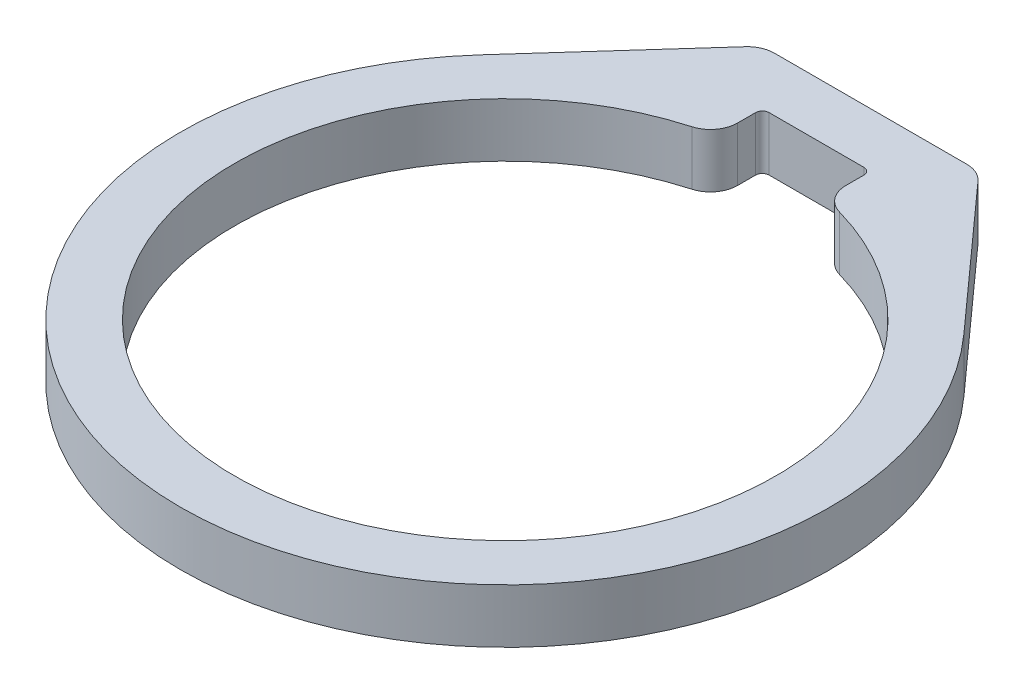
ISO-10303-21;
HEADER;
FILE_DESCRIPTION(('STEP AP214'),'2;1');
FILE_NAME('part.step','',(''),(''),'','','');
FILE_SCHEMA(('AUTOMOTIVE_DESIGN { 1 0 10303 214 1 1 1 1 }'));
ENDSEC;
DATA;
#1=APPLICATION_CONTEXT('core data for automotive mechanical design processes');
#2=APPLICATION_PROTOCOL_DEFINITION('international standard','automotive_design',2000,#1);
#3=PRODUCT_CONTEXT('',#1,'mechanical');
#4=PRODUCT('Part','Part','',(#3));
#5=PRODUCT_RELATED_PRODUCT_CATEGORY('part','',(#4));
#6=PRODUCT_DEFINITION_FORMATION('','',#4);
#7=PRODUCT_DEFINITION_CONTEXT('part definition',#1,'design');
#8=PRODUCT_DEFINITION('design','',#6,#7);
#9=PRODUCT_DEFINITION_SHAPE('','',#8);
#10=(LENGTH_UNIT() NAMED_UNIT(*) SI_UNIT(.MILLI.,.METRE.));
#11=(NAMED_UNIT(*) PLANE_ANGLE_UNIT() SI_UNIT($,.RADIAN.));
#12=(NAMED_UNIT(*) SI_UNIT($,.STERADIAN.) SOLID_ANGLE_UNIT());
#13=UNCERTAINTY_MEASURE_WITH_UNIT(LENGTH_MEASURE(1.E-05),#10,'distance_accuracy_value','');
#14=(GEOMETRIC_REPRESENTATION_CONTEXT(3) GLOBAL_UNCERTAINTY_ASSIGNED_CONTEXT((#13)) GLOBAL_UNIT_ASSIGNED_CONTEXT((#10,
#11,#12)) REPRESENTATION_CONTEXT('',''));
#15=CARTESIAN_POINT('',(0.,0.,0.));
#16=DIRECTION('',(0.,0.,1.));
#17=DIRECTION('',(1.,0.,0.));
#18=AXIS2_PLACEMENT_3D('',#15,#16,#17);
#19=CARTESIAN_POINT('',(0.,6.35,0.));
#20=DIRECTION('',(0.,1.,0.));
#21=DIRECTION('',(0.,0.,1.));
#22=AXIS2_PLACEMENT_3D('',#19,#20,#21);
#23=PLANE('',#22);
#24=DIRECTION('',(-0.668540531019861,0.,-0.743675707807968));
#25=VECTOR('',#24,1.);
#26=CARTESIAN_POINT('',(12.7,6.35,-42.8625));
#27=LINE('',#26,#25);
#28=CARTESIAN_POINT('',(28.3340444674836,6.35,-25.4713942318567));
#29=VERTEX_POINT('',#28);
#30=CARTESIAN_POINT('',(13.6460591847622,6.35,-41.8101161859881));
#31=VERTEX_POINT('',#30);
#32=EDGE_CURVE('E139',#29,#31,#27,.T.);
#33=ORIENTED_EDGE('',*,*,#32,.T.);
#34=CARTESIAN_POINT('',(11.2848888124719,6.35,-39.6875));
#35=DIRECTION('',(0.,1.,0.));
#36=DIRECTION('',(0.,0.,1.));
#37=AXIS2_PLACEMENT_3D('',#34,#35,#36);
#38=CIRCLE('',#37,3.175);
#39=CARTESIAN_POINT('',(11.2848888124719,6.35,-42.8625));
#40=VERTEX_POINT('',#39);
#41=EDGE_CURVE('E207',#31,#40,#38,.T.);
#42=ORIENTED_EDGE('',*,*,#41,.T.);
#43=DIRECTION('',(-1.,0.,0.));
#44=VECTOR('',#43,1.);
#45=CARTESIAN_POINT('',(-12.7,6.35,-42.8625));
#46=LINE('',#45,#44);
#47=CARTESIAN_POINT('',(-11.2848888124719,6.35,-42.8625));
#48=VERTEX_POINT('',#47);
#49=EDGE_CURVE('E150',#40,#48,#46,.T.);
#50=ORIENTED_EDGE('',*,*,#49,.T.);
#51=CARTESIAN_POINT('',(-11.2848888124719,6.35,-39.6875));
#52=DIRECTION('',(0.,1.,0.));
#53=DIRECTION('',(0.,0.,1.));
#54=AXIS2_PLACEMENT_3D('',#51,#52,#53);
#55=CIRCLE('',#54,3.175);
#56=CARTESIAN_POINT('',(-13.6460591847622,6.35,-41.8101161859881));
#57=VERTEX_POINT('',#56);
#58=EDGE_CURVE('E205',#48,#57,#55,.T.);
#59=ORIENTED_EDGE('',*,*,#58,.T.);
#60=DIRECTION('',(-0.668540531019861,0.,0.743675707807968));
#61=VECTOR('',#60,1.);
#62=CARTESIAN_POINT('',(-12.7,6.35,-42.8625));
#63=LINE('',#62,#61);
#64=CARTESIAN_POINT('',(-28.3340444674836,6.35,-25.4713942318567));
#65=VERTEX_POINT('',#64);
#66=EDGE_CURVE('E155',#57,#65,#63,.T.);
#67=ORIENTED_EDGE('',*,*,#66,.T.);
#68=CARTESIAN_POINT('',(0.,6.35,0.));
#69=DIRECTION('',(0.,1.,0.));
#70=DIRECTION('',(0.,0.,1.));
#71=AXIS2_PLACEMENT_3D('',#68,#69,#70);
#72=CIRCLE('',#71,38.1);
#73=EDGE_CURVE('E151',#65,#29,#72,.T.);
#74=ORIENTED_EDGE('',*,*,#73,.T.);
#75=EDGE_LOOP('',(#33,#42,#50,#59,#67,#74));
#76=FACE_BOUND('',#75,.T.);
#77=DIRECTION('',(0.,0.,-1.));
#78=VECTOR('',#77,1.);
#79=CARTESIAN_POINT('',(6.35,6.35,-36.5125));
#80=LINE('',#79,#78);
#81=CARTESIAN_POINT('',(6.35,6.35,-33.6010416505203));
#82=VERTEX_POINT('',#81);
#83=CARTESIAN_POINT('',(6.35,6.35,-35.71875));
#84=VERTEX_POINT('',#83);
#85=EDGE_CURVE('E311',#82,#84,#80,.T.);
#86=ORIENTED_EDGE('',*,*,#85,.F.);
#87=CARTESIAN_POINT('',(9.525,6.35,-33.6010416505203));
#88=DIRECTION('',(0.,1.,0.));
#89=DIRECTION('',(0.,0.,1.));
#90=AXIS2_PLACEMENT_3D('',#87,#88,#89);
#91=CIRCLE('',#90,3.175);
#92=CARTESIAN_POINT('',(8.65909090909091,6.35,-30.546401500473));
#93=VERTEX_POINT('',#92);
#94=EDGE_CURVE('E203',#82,#93,#91,.T.);
#95=ORIENTED_EDGE('',*,*,#94,.T.);
#96=CARTESIAN_POINT('',(0.,6.35,0.));
#97=DIRECTION('',(0.,1.,0.));
#98=DIRECTION('',(0.,0.,1.));
#99=AXIS2_PLACEMENT_3D('',#96,#97,#98);
#100=CIRCLE('',#99,31.75);
#101=CARTESIAN_POINT('',(-8.65909090909091,6.35,-30.546401500473));
#102=VERTEX_POINT('',#101);
#103=EDGE_CURVE('E224',#102,#93,#100,.T.);
#104=ORIENTED_EDGE('',*,*,#103,.F.);
#105=CARTESIAN_POINT('',(-9.525,6.35,-33.6010416505203));
#106=DIRECTION('',(0.,1.,0.));
#107=DIRECTION('',(0.,0.,1.));
#108=AXIS2_PLACEMENT_3D('',#105,#106,#107);
#109=CIRCLE('',#108,3.175);
#110=CARTESIAN_POINT('',(-6.35,6.35,-33.6010416505203));
#111=VERTEX_POINT('',#110);
#112=EDGE_CURVE('E58',#102,#111,#109,.T.);
#113=ORIENTED_EDGE('',*,*,#112,.T.);
#114=DIRECTION('',(0.,0.,1.));
#115=VECTOR('',#114,1.);
#116=CARTESIAN_POINT('',(-6.35,6.35,-36.5125));
#117=LINE('',#116,#115);
#118=CARTESIAN_POINT('',(-6.35,6.35,-35.71875));
#119=VERTEX_POINT('',#118);
#120=EDGE_CURVE('E239',#119,#111,#117,.T.);
#121=ORIENTED_EDGE('',*,*,#120,.F.);
#122=CARTESIAN_POINT('',(-5.55625,6.35,-35.71875));
#123=DIRECTION('',(0.,1.,0.));
#124=DIRECTION('',(0.,0.,1.));
#125=AXIS2_PLACEMENT_3D('',#122,#123,#124);
#126=CIRCLE('',#125,0.79375);
#127=CARTESIAN_POINT('',(-5.55625,6.35,-36.5125));
#128=VERTEX_POINT('',#127);
#129=EDGE_CURVE('E186',#119,#128,#126,.F.);
#130=ORIENTED_EDGE('',*,*,#129,.T.);
#131=DIRECTION('',(-1.,0.,0.));
#132=VECTOR('',#131,1.);
#133=CARTESIAN_POINT('',(-6.35,6.35,-36.5125));
#134=LINE('',#133,#132);
#135=CARTESIAN_POINT('',(5.55625,6.35,-36.5125));
#136=VERTEX_POINT('',#135);
#137=EDGE_CURVE('E246',#136,#128,#134,.T.);
#138=ORIENTED_EDGE('',*,*,#137,.F.);
#139=CARTESIAN_POINT('',(5.55625,6.35,-35.71875));
#140=DIRECTION('',(0.,1.,0.));
#141=DIRECTION('',(0.,0.,1.));
#142=AXIS2_PLACEMENT_3D('',#139,#140,#141);
#143=CIRCLE('',#142,0.79375);
#144=EDGE_CURVE('E181',#136,#84,#143,.F.);
#145=ORIENTED_EDGE('',*,*,#144,.T.);
#146=EDGE_LOOP('',(#86,#95,#104,#113,#121,#130,#138,#145));
#147=FACE_BOUND('',#146,.T.);
#148=ADVANCED_FACE('F36',(#76,#147),#23,.T.);
#149=CARTESIAN_POINT('',(0.,0.,0.));
#150=DIRECTION('',(0.,1.,0.));
#151=DIRECTION('',(0.,0.,1.));
#152=AXIS2_PLACEMENT_3D('',#149,#150,#151);
#153=PLANE('',#152);
#154=DIRECTION('',(-1.,0.,0.));
#155=VECTOR('',#154,1.);
#156=CARTESIAN_POINT('',(-12.7,0.,-42.8625));
#157=LINE('',#156,#155);
#158=CARTESIAN_POINT('',(11.2848888124719,0.,-42.8625));
#159=VERTEX_POINT('',#158);
#160=CARTESIAN_POINT('',(-11.2848888124719,0.,-42.8625));
#161=VERTEX_POINT('',#160);
#162=EDGE_CURVE('E248',#159,#161,#157,.T.);
#163=ORIENTED_EDGE('',*,*,#162,.F.);
#164=CARTESIAN_POINT('',(11.2848888124719,0.,-39.6875));
#165=DIRECTION('',(0.,1.,0.));
#166=DIRECTION('',(0.,0.,1.));
#167=AXIS2_PLACEMENT_3D('',#164,#165,#166);
#168=CIRCLE('',#167,3.175);
#169=CARTESIAN_POINT('',(13.6460591847622,0.,-41.8101161859881));
#170=VERTEX_POINT('',#169);
#171=EDGE_CURVE('E199',#159,#170,#168,.F.);
#172=ORIENTED_EDGE('',*,*,#171,.T.);
#173=DIRECTION('',(-0.668540531019861,0.,-0.743675707807968));
#174=VECTOR('',#173,1.);
#175=CARTESIAN_POINT('',(12.7,0.,-42.8625));
#176=LINE('',#175,#174);
#177=CARTESIAN_POINT('',(28.3340444674836,0.,-25.4713942318567));
#178=VERTEX_POINT('',#177);
#179=EDGE_CURVE('E245',#178,#170,#176,.T.);
#180=ORIENTED_EDGE('',*,*,#179,.F.);
#181=CARTESIAN_POINT('',(0.,0.,0.));
#182=DIRECTION('',(0.,1.,0.));
#183=DIRECTION('',(0.,0.,1.));
#184=AXIS2_PLACEMENT_3D('',#181,#182,#183);
#185=CIRCLE('',#184,38.1);
#186=CARTESIAN_POINT('',(-28.3340444674836,0.,-25.4713942318567));
#187=VERTEX_POINT('',#186);
#188=EDGE_CURVE('E163',#187,#178,#185,.T.);
#189=ORIENTED_EDGE('',*,*,#188,.F.);
#190=DIRECTION('',(-0.668540531019861,0.,0.743675707807968));
#191=VECTOR('',#190,1.);
#192=CARTESIAN_POINT('',(-12.7,0.,-42.8625));
#193=LINE('',#192,#191);
#194=CARTESIAN_POINT('',(-13.6460591847622,0.,-41.8101161859881));
#195=VERTEX_POINT('',#194);
#196=EDGE_CURVE('E159',#195,#187,#193,.T.);
#197=ORIENTED_EDGE('',*,*,#196,.F.);
#198=CARTESIAN_POINT('',(-11.2848888124719,0.,-39.6875));
#199=DIRECTION('',(0.,1.,0.));
#200=DIRECTION('',(0.,0.,1.));
#201=AXIS2_PLACEMENT_3D('',#198,#199,#200);
#202=CIRCLE('',#201,3.175);
#203=EDGE_CURVE('E197',#195,#161,#202,.F.);
#204=ORIENTED_EDGE('',*,*,#203,.T.);
#205=EDGE_LOOP('',(#163,#172,#180,#189,#197,#204));
#206=FACE_BOUND('',#205,.T.);
#207=CARTESIAN_POINT('',(0.,0.,0.));
#208=DIRECTION('',(0.,1.,0.));
#209=DIRECTION('',(0.,0.,1.));
#210=AXIS2_PLACEMENT_3D('',#207,#208,#209);
#211=CIRCLE('',#210,31.75);
#212=CARTESIAN_POINT('',(-8.65909090909091,0.,-30.546401500473));
#213=VERTEX_POINT('',#212);
#214=CARTESIAN_POINT('',(8.65909090909091,0.,-30.546401500473));
#215=VERTEX_POINT('',#214);
#216=EDGE_CURVE('E222',#213,#215,#211,.T.);
#217=ORIENTED_EDGE('',*,*,#216,.T.);
#218=CARTESIAN_POINT('',(9.525,0.,-33.6010416505203));
#219=DIRECTION('',(0.,1.,0.));
#220=DIRECTION('',(0.,0.,1.));
#221=AXIS2_PLACEMENT_3D('',#218,#219,#220);
#222=CIRCLE('',#221,3.175);
#223=CARTESIAN_POINT('',(6.35,0.,-33.6010416505203));
#224=VERTEX_POINT('',#223);
#225=EDGE_CURVE('E195',#215,#224,#222,.F.);
#226=ORIENTED_EDGE('',*,*,#225,.T.);
#227=DIRECTION('',(0.,0.,-1.));
#228=VECTOR('',#227,1.);
#229=CARTESIAN_POINT('',(6.35,0.,-36.5125));
#230=LINE('',#229,#228);
#231=CARTESIAN_POINT('',(6.35,0.,-35.71875));
#232=VERTEX_POINT('',#231);
#233=EDGE_CURVE('E230',#224,#232,#230,.T.);
#234=ORIENTED_EDGE('',*,*,#233,.T.);
#235=CARTESIAN_POINT('',(5.55625,0.,-35.71875));
#236=DIRECTION('',(0.,1.,0.));
#237=DIRECTION('',(0.,0.,1.));
#238=AXIS2_PLACEMENT_3D('',#235,#236,#237);
#239=CIRCLE('',#238,0.79375);
#240=CARTESIAN_POINT('',(5.55625,0.,-36.5125));
#241=VERTEX_POINT('',#240);
#242=EDGE_CURVE('E179',#232,#241,#239,.T.);
#243=ORIENTED_EDGE('',*,*,#242,.T.);
#244=DIRECTION('',(-1.,0.,0.));
#245=VECTOR('',#244,1.);
#246=CARTESIAN_POINT('',(-6.35,0.,-36.5125));
#247=LINE('',#246,#245);
#248=CARTESIAN_POINT('',(-5.55625,0.,-36.5125));
#249=VERTEX_POINT('',#248);
#250=EDGE_CURVE('E233',#241,#249,#247,.T.);
#251=ORIENTED_EDGE('',*,*,#250,.T.);
#252=CARTESIAN_POINT('',(-5.55625,0.,-35.71875));
#253=DIRECTION('',(0.,1.,0.));
#254=DIRECTION('',(0.,0.,1.));
#255=AXIS2_PLACEMENT_3D('',#252,#253,#254);
#256=CIRCLE('',#255,0.79375);
#257=CARTESIAN_POINT('',(-6.35,0.,-35.71875));
#258=VERTEX_POINT('',#257);
#259=EDGE_CURVE('E184',#249,#258,#256,.T.);
#260=ORIENTED_EDGE('',*,*,#259,.T.);
#261=DIRECTION('',(0.,0.,1.));
#262=VECTOR('',#261,1.);
#263=CARTESIAN_POINT('',(-6.35,0.,-36.5125));
#264=LINE('',#263,#262);
#265=CARTESIAN_POINT('',(-6.35,0.,-33.6010416505203));
#266=VERTEX_POINT('',#265);
#267=EDGE_CURVE('E231',#258,#266,#264,.T.);
#268=ORIENTED_EDGE('',*,*,#267,.T.);
#269=CARTESIAN_POINT('',(-9.525,0.,-33.6010416505203));
#270=DIRECTION('',(0.,1.,0.));
#271=DIRECTION('',(0.,0.,1.));
#272=AXIS2_PLACEMENT_3D('',#269,#270,#271);
#273=CIRCLE('',#272,3.175);
#274=EDGE_CURVE('E193',#266,#213,#273,.F.);
#275=ORIENTED_EDGE('',*,*,#274,.T.);
#276=EDGE_LOOP('',(#217,#226,#234,#243,#251,#260,#268,#275));
#277=FACE_BOUND('',#276,.T.);
#278=ADVANCED_FACE('F228',(#206,#277),#153,.F.);
#279=CARTESIAN_POINT('',(0.,6.35,0.));
#280=DIRECTION('',(0.,-1.,0.));
#281=DIRECTION('',(0.,0.,-1.));
#282=AXIS2_PLACEMENT_3D('',#279,#280,#281);
#283=CYLINDRICAL_SURFACE('',#282,38.1);
#284=ORIENTED_EDGE('',*,*,#188,.T.);
#285=DIRECTION('',(0.,-1.,0.));
#286=VECTOR('',#285,1.);
#287=CARTESIAN_POINT('',(28.3340444674836,6.35,-25.4713942318567));
#288=LINE('',#287,#286);
#289=EDGE_CURVE('E144',#29,#178,#288,.T.);
#290=ORIENTED_EDGE('',*,*,#289,.F.);
#291=ORIENTED_EDGE('',*,*,#73,.F.);
#292=DIRECTION('',(0.,-1.,0.));
#293=VECTOR('',#292,1.);
#294=CARTESIAN_POINT('',(-28.3340444674836,6.35,-25.4713942318567));
#295=LINE('',#294,#293);
#296=EDGE_CURVE('E165',#65,#187,#295,.T.);
#297=ORIENTED_EDGE('',*,*,#296,.T.);
#298=EDGE_LOOP('',(#284,#290,#291,#297));
#299=FACE_BOUND('',#298,.T.);
#300=ADVANCED_FACE('F161',(#299),#283,.T.);
#301=CARTESIAN_POINT('',(12.7,6.35,-42.8625));
#302=DIRECTION('',(-0.743675707807968,0.,0.668540531019862));
#303=DIRECTION('',(0.668540531019861,0.,0.743675707807968));
#304=AXIS2_PLACEMENT_3D('',#301,#302,#303);
#305=PLANE('',#304);
#306=ORIENTED_EDGE('',*,*,#179,.T.);
#307=DIRECTION('',(0.,-1.,0.));
#308=VECTOR('',#307,1.);
#309=CARTESIAN_POINT('',(13.6460591847622,6.35,-41.8101161859881));
#310=LINE('',#309,#308);
#311=EDGE_CURVE('E147',#170,#31,#310,.F.);
#312=ORIENTED_EDGE('',*,*,#311,.T.);
#313=ORIENTED_EDGE('',*,*,#32,.F.);
#314=ORIENTED_EDGE('',*,*,#289,.T.);
#315=EDGE_LOOP('',(#306,#312,#313,#314));
#316=FACE_BOUND('',#315,.T.);
#317=ADVANCED_FACE('F142',(#316),#305,.F.);
#318=CARTESIAN_POINT('',(-12.7,6.35,-42.8625));
#319=DIRECTION('',(0.,0.,1.));
#320=DIRECTION('',(1.,0.,0.));
#321=AXIS2_PLACEMENT_3D('',#318,#319,#320);
#322=PLANE('',#321);
#323=ORIENTED_EDGE('',*,*,#49,.F.);
#324=DIRECTION('',(0.,-1.,0.));
#325=VECTOR('',#324,1.);
#326=CARTESIAN_POINT('',(11.2848888124719,6.35,-42.8625));
#327=LINE('',#326,#325);
#328=EDGE_CURVE('E190',#40,#159,#327,.T.);
#329=ORIENTED_EDGE('',*,*,#328,.T.);
#330=ORIENTED_EDGE('',*,*,#162,.T.);
#331=DIRECTION('',(0.,-1.,0.));
#332=VECTOR('',#331,1.);
#333=CARTESIAN_POINT('',(-11.2848888124719,6.35,-42.8625));
#334=LINE('',#333,#332);
#335=EDGE_CURVE('E188',#161,#48,#334,.F.);
#336=ORIENTED_EDGE('',*,*,#335,.T.);
#337=EDGE_LOOP('',(#323,#329,#330,#336));
#338=FACE_BOUND('',#337,.T.);
#339=ADVANCED_FACE('F262',(#338),#322,.F.);
#340=CARTESIAN_POINT('',(-12.7,6.35,-42.8625));
#341=DIRECTION('',(0.743675707807968,0.,0.668540531019862));
#342=DIRECTION('',(0.668540531019861,0.,-0.743675707807968));
#343=AXIS2_PLACEMENT_3D('',#340,#341,#342);
#344=PLANE('',#343);
#345=ORIENTED_EDGE('',*,*,#66,.F.);
#346=DIRECTION('',(0.,-1.,0.));
#347=VECTOR('',#346,1.);
#348=CARTESIAN_POINT('',(-13.6460591847622,6.35,-41.8101161859881));
#349=LINE('',#348,#347);
#350=EDGE_CURVE('E209',#57,#195,#349,.T.);
#351=ORIENTED_EDGE('',*,*,#350,.T.);
#352=ORIENTED_EDGE('',*,*,#196,.T.);
#353=ORIENTED_EDGE('',*,*,#296,.F.);
#354=EDGE_LOOP('',(#345,#351,#352,#353));
#355=FACE_BOUND('',#354,.T.);
#356=ADVANCED_FACE('F252',(#355),#344,.F.);
#357=CARTESIAN_POINT('',(-6.35,6.35,-36.5125));
#358=DIRECTION('',(1.,0.,0.));
#359=DIRECTION('',(0.,0.,-1.));
#360=AXIS2_PLACEMENT_3D('',#357,#358,#359);
#361=PLANE('',#360);
#362=ORIENTED_EDGE('',*,*,#120,.T.);
#363=DIRECTION('',(0.,-1.,0.));
#364=VECTOR('',#363,1.);
#365=CARTESIAN_POINT('',(-6.35,6.35,-33.6010416505203));
#366=LINE('',#365,#364);
#367=EDGE_CURVE('E11',#111,#266,#366,.T.);
#368=ORIENTED_EDGE('',*,*,#367,.T.);
#369=ORIENTED_EDGE('',*,*,#267,.F.);
#370=DIRECTION('',(0.,-1.,0.));
#371=VECTOR('',#370,1.);
#372=CARTESIAN_POINT('',(-6.35,6.35,-35.71875));
#373=LINE('',#372,#371);
#374=EDGE_CURVE('E177',#258,#119,#373,.F.);
#375=ORIENTED_EDGE('',*,*,#374,.T.);
#376=EDGE_LOOP('',(#362,#368,#369,#375));
#377=FACE_BOUND('',#376,.T.);
#378=ADVANCED_FACE('F282',(#377),#361,.T.);
#379=CARTESIAN_POINT('',(0.,6.35,0.));
#380=DIRECTION('',(0.,-1.,0.));
#381=DIRECTION('',(0.,0.,-1.));
#382=AXIS2_PLACEMENT_3D('',#379,#380,#381);
#383=CYLINDRICAL_SURFACE('',#382,31.75);
#384=ORIENTED_EDGE('',*,*,#103,.T.);
#385=DIRECTION('',(0.,-1.,0.));
#386=VECTOR('',#385,1.);
#387=CARTESIAN_POINT('',(8.65909090909091,6.35,-30.546401500473));
#388=LINE('',#387,#386);
#389=EDGE_CURVE('E214',#93,#215,#388,.T.);
#390=ORIENTED_EDGE('',*,*,#389,.T.);
#391=ORIENTED_EDGE('',*,*,#216,.F.);
#392=DIRECTION('',(0.,-1.,0.));
#393=VECTOR('',#392,1.);
#394=CARTESIAN_POINT('',(-8.65909090909091,6.35,-30.546401500473));
#395=LINE('',#394,#393);
#396=EDGE_CURVE('E212',#213,#102,#395,.F.);
#397=ORIENTED_EDGE('',*,*,#396,.T.);
#398=EDGE_LOOP('',(#384,#390,#391,#397));
#399=FACE_BOUND('',#398,.T.);
#400=ADVANCED_FACE('F221',(#399),#383,.F.);
#401=CARTESIAN_POINT('',(6.35,6.35,-36.5125));
#402=DIRECTION('',(-1.,0.,0.));
#403=DIRECTION('',(0.,0.,1.));
#404=AXIS2_PLACEMENT_3D('',#401,#402,#403);
#405=PLANE('',#404);
#406=ORIENTED_EDGE('',*,*,#233,.F.);
#407=DIRECTION('',(0.,-1.,0.));
#408=VECTOR('',#407,1.);
#409=CARTESIAN_POINT('',(6.35,6.35,-33.6010416505203));
#410=LINE('',#409,#408);
#411=EDGE_CURVE('E44',#224,#82,#410,.F.);
#412=ORIENTED_EDGE('',*,*,#411,.T.);
#413=ORIENTED_EDGE('',*,*,#85,.T.);
#414=DIRECTION('',(0.,-1.,0.));
#415=VECTOR('',#414,1.);
#416=CARTESIAN_POINT('',(6.35,0.,-35.71875));
#417=LINE('',#416,#415);
#418=EDGE_CURVE('E164',#84,#232,#417,.T.);
#419=ORIENTED_EDGE('',*,*,#418,.T.);
#420=EDGE_LOOP('',(#406,#412,#413,#419));
#421=FACE_BOUND('',#420,.T.);
#422=ADVANCED_FACE('F320',(#421),#405,.T.);
#423=CARTESIAN_POINT('',(-6.35,6.35,-36.5125));
#424=DIRECTION('',(0.,0.,1.));
#425=DIRECTION('',(1.,0.,0.));
#426=AXIS2_PLACEMENT_3D('',#423,#424,#425);
#427=PLANE('',#426);
#428=ORIENTED_EDGE('',*,*,#250,.F.);
#429=DIRECTION('',(0.,-1.,0.));
#430=VECTOR('',#429,1.);
#431=CARTESIAN_POINT('',(5.55625,6.35,-36.5125));
#432=LINE('',#431,#430);
#433=EDGE_CURVE('E175',#241,#136,#432,.F.);
#434=ORIENTED_EDGE('',*,*,#433,.T.);
#435=ORIENTED_EDGE('',*,*,#137,.T.);
#436=DIRECTION('',(0.,-1.,0.));
#437=VECTOR('',#436,1.);
#438=CARTESIAN_POINT('',(-5.55625,0.,-36.5125));
#439=LINE('',#438,#437);
#440=EDGE_CURVE('E168',#128,#249,#439,.T.);
#441=ORIENTED_EDGE('',*,*,#440,.T.);
#442=EDGE_LOOP('',(#428,#434,#435,#441));
#443=FACE_BOUND('',#442,.T.);
#444=ADVANCED_FACE('F296',(#443),#427,.T.);
#445=CARTESIAN_POINT('',(5.55625,6.35,-35.71875));
#446=DIRECTION('',(0.,1.,0.));
#447=DIRECTION('',(0.,0.,1.));
#448=AXIS2_PLACEMENT_3D('',#445,#446,#447);
#449=CYLINDRICAL_SURFACE('',#448,0.79375);
#450=ORIENTED_EDGE('',*,*,#144,.F.);
#451=ORIENTED_EDGE('',*,*,#433,.F.);
#452=ORIENTED_EDGE('',*,*,#242,.F.);
#453=ORIENTED_EDGE('',*,*,#418,.F.);
#454=EDGE_LOOP('',(#450,#451,#452,#453));
#455=FACE_BOUND('',#454,.T.);
#456=ADVANCED_FACE('F293',(#455),#449,.F.);
#457=CARTESIAN_POINT('',(-5.55625,6.35,-35.71875));
#458=DIRECTION('',(0.,1.,0.));
#459=DIRECTION('',(0.,0.,1.));
#460=AXIS2_PLACEMENT_3D('',#457,#458,#459);
#461=CYLINDRICAL_SURFACE('',#460,0.79375);
#462=ORIENTED_EDGE('',*,*,#129,.F.);
#463=ORIENTED_EDGE('',*,*,#374,.F.);
#464=ORIENTED_EDGE('',*,*,#259,.F.);
#465=ORIENTED_EDGE('',*,*,#440,.F.);
#466=EDGE_LOOP('',(#462,#463,#464,#465));
#467=FACE_BOUND('',#466,.T.);
#468=ADVANCED_FACE('F273',(#467),#461,.F.);
#469=CARTESIAN_POINT('',(11.2848888124719,6.35,-39.6875));
#470=DIRECTION('',(0.,-1.,0.));
#471=DIRECTION('',(0.,0.,-1.));
#472=AXIS2_PLACEMENT_3D('',#469,#470,#471);
#473=CYLINDRICAL_SURFACE('',#472,3.175);
#474=ORIENTED_EDGE('',*,*,#41,.F.);
#475=ORIENTED_EDGE('',*,*,#311,.F.);
#476=ORIENTED_EDGE('',*,*,#171,.F.);
#477=ORIENTED_EDGE('',*,*,#328,.F.);
#478=EDGE_LOOP('',(#474,#475,#476,#477));
#479=FACE_BOUND('',#478,.T.);
#480=ADVANCED_FACE('F257',(#479),#473,.T.);
#481=CARTESIAN_POINT('',(-11.2848888124719,6.35,-39.6875));
#482=DIRECTION('',(0.,-1.,0.));
#483=DIRECTION('',(0.,0.,-1.));
#484=AXIS2_PLACEMENT_3D('',#481,#482,#483);
#485=CYLINDRICAL_SURFACE('',#484,3.175);
#486=ORIENTED_EDGE('',*,*,#58,.F.);
#487=ORIENTED_EDGE('',*,*,#335,.F.);
#488=ORIENTED_EDGE('',*,*,#203,.F.);
#489=ORIENTED_EDGE('',*,*,#350,.F.);
#490=EDGE_LOOP('',(#486,#487,#488,#489));
#491=FACE_BOUND('',#490,.T.);
#492=ADVANCED_FACE('F265',(#491),#485,.T.);
#493=CARTESIAN_POINT('',(9.525,6.35,-33.6010416505203));
#494=DIRECTION('',(0.,-1.,0.));
#495=DIRECTION('',(0.,0.,-1.));
#496=AXIS2_PLACEMENT_3D('',#493,#494,#495);
#497=CYLINDRICAL_SURFACE('',#496,3.175);
#498=ORIENTED_EDGE('',*,*,#94,.F.);
#499=ORIENTED_EDGE('',*,*,#411,.F.);
#500=ORIENTED_EDGE('',*,*,#225,.F.);
#501=ORIENTED_EDGE('',*,*,#389,.F.);
#502=EDGE_LOOP('',(#498,#499,#500,#501));
#503=FACE_BOUND('',#502,.T.);
#504=ADVANCED_FACE('F267',(#503),#497,.T.);
#505=CARTESIAN_POINT('',(-9.525,6.35,-33.6010416505203));
#506=DIRECTION('',(0.,-1.,0.));
#507=DIRECTION('',(0.,0.,-1.));
#508=AXIS2_PLACEMENT_3D('',#505,#506,#507);
#509=CYLINDRICAL_SURFACE('',#508,3.175);
#510=ORIENTED_EDGE('',*,*,#112,.F.);
#511=ORIENTED_EDGE('',*,*,#396,.F.);
#512=ORIENTED_EDGE('',*,*,#274,.F.);
#513=ORIENTED_EDGE('',*,*,#367,.F.);
#514=EDGE_LOOP('',(#510,#511,#512,#513));
#515=FACE_BOUND('',#514,.T.);
#516=ADVANCED_FACE('F38',(#515),#509,.T.);
#517=CLOSED_SHELL('',(#148,#278,#300,#317,#339,#356,#378,#400,#422,#444,#456,#468,#480,#492,
#504,#516));
#518=MANIFOLD_SOLID_BREP('B2',#517);
#519=ADVANCED_BREP_SHAPE_REPRESENTATION('',(#18,#518),#14);
#520=SHAPE_DEFINITION_REPRESENTATION(#9,#519);
ENDSEC;
END-ISO-10303-21;
